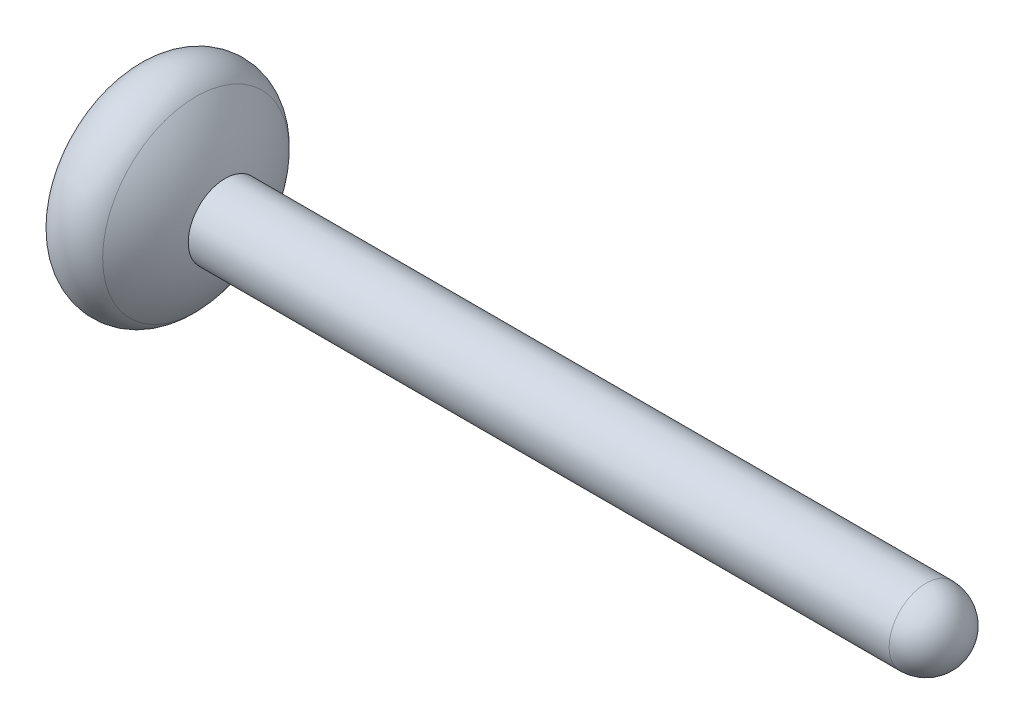
ISO-10303-21;
HEADER;
FILE_DESCRIPTION(('STEP AP214'),'2;1');
FILE_NAME('part.step','',(''),(''),'','','');
FILE_SCHEMA(('AUTOMOTIVE_DESIGN { 1 0 10303 214 1 1 1 1 }'));
ENDSEC;
DATA;
#1=APPLICATION_CONTEXT('core data for automotive mechanical design processes');
#2=APPLICATION_PROTOCOL_DEFINITION('international standard','automotive_design',2000,#1);
#3=PRODUCT_CONTEXT('',#1,'mechanical');
#4=PRODUCT('Part','Part','',(#3));
#5=PRODUCT_RELATED_PRODUCT_CATEGORY('part','',(#4));
#6=PRODUCT_DEFINITION_FORMATION('','',#4);
#7=PRODUCT_DEFINITION_CONTEXT('part definition',#1,'design');
#8=PRODUCT_DEFINITION('design','',#6,#7);
#9=PRODUCT_DEFINITION_SHAPE('','',#8);
#10=(LENGTH_UNIT() NAMED_UNIT(*) SI_UNIT(.MILLI.,.METRE.));
#11=(NAMED_UNIT(*) PLANE_ANGLE_UNIT() SI_UNIT($,.RADIAN.));
#12=(NAMED_UNIT(*) SI_UNIT($,.STERADIAN.) SOLID_ANGLE_UNIT());
#13=UNCERTAINTY_MEASURE_WITH_UNIT(LENGTH_MEASURE(1.E-05),#10,'distance_accuracy_value','');
#14=(GEOMETRIC_REPRESENTATION_CONTEXT(3) GLOBAL_UNCERTAINTY_ASSIGNED_CONTEXT((#13)) GLOBAL_UNIT_ASSIGNED_CONTEXT((#10,
#11,#12)) REPRESENTATION_CONTEXT('',''));
#15=CARTESIAN_POINT('',(0.,0.,0.));
#16=DIRECTION('',(0.,0.,1.));
#17=DIRECTION('',(1.,0.,0.));
#18=AXIS2_PLACEMENT_3D('',#15,#16,#17);
#19=CARTESIAN_POINT('',(0.,0.,0.));
#20=DIRECTION('',(-1.,0.,0.));
#21=DIRECTION('',(0.,0.,1.));
#22=AXIS2_PLACEMENT_3D('',#19,#20,#21);
#23=CYLINDRICAL_SURFACE('',#22,0.5);
#24=CARTESIAN_POINT('',(11.4,0.,0.));
#25=DIRECTION('',(-1.,0.,0.));
#26=DIRECTION('',(0.,0.,1.));
#27=AXIS2_PLACEMENT_3D('',#24,#25,#26);
#28=CIRCLE('',#27,0.5);
#29=CARTESIAN_POINT('',(11.4,0.,0.5));
#30=VERTEX_POINT('',#29);
#31=EDGE_CURVE('E45',#30,#30,#28,.T.);
#32=ORIENTED_EDGE('',*,*,#31,.T.);
#33=EDGE_LOOP('',(#32));
#34=FACE_BOUND('',#33,.T.);
#35=CARTESIAN_POINT('',(1.9,0.,0.));
#36=DIRECTION('',(-1.,0.,0.));
#37=DIRECTION('',(0.,0.,1.));
#38=AXIS2_PLACEMENT_3D('',#35,#36,#37);
#39=CIRCLE('',#38,0.5);
#40=CARTESIAN_POINT('',(1.9,0.,0.5));
#41=VERTEX_POINT('',#40);
#42=EDGE_CURVE('E49',#41,#41,#39,.T.);
#43=ORIENTED_EDGE('',*,*,#42,.F.);
#44=EDGE_LOOP('',(#43));
#45=FACE_BOUND('',#44,.T.);
#46=ADVANCED_FACE('F34',(#34,#45),#23,.T.);
#47=CARTESIAN_POINT('',(0.,0.,0.));
#48=DIRECTION('',(-1.,0.,0.));
#49=DIRECTION('',(0.,1.,0.));
#50=AXIS2_PLACEMENT_3D('',#47,#48,#49);
#51=SPHERICAL_SURFACE('',#50,1.96468827043885);
#52=CARTESIAN_POINT('',(1.50416395454947,0.,0.));
#53=DIRECTION('',(-1.,0.,0.));
#54=DIRECTION('',(0.,0.,1.));
#55=AXIS2_PLACEMENT_3D('',#52,#53,#54);
#56=CIRCLE('',#55,1.26391882565064);
#57=CARTESIAN_POINT('',(1.50416395454947,0.,1.26391882565064));
#58=VERTEX_POINT('',#57);
#59=EDGE_CURVE('E10',#58,#58,#56,.F.);
#60=ORIENTED_EDGE('',*,*,#59,.T.);
#61=EDGE_LOOP('',(#60));
#62=FACE_BOUND('',#61,.T.);
#63=ORIENTED_EDGE('',*,*,#42,.T.);
#64=EDGE_LOOP('',(#63));
#65=FACE_BOUND('',#64,.T.);
#66=ADVANCED_FACE('F62',(#62,#65),#51,.T.);
#67=CARTESIAN_POINT('',(0.98234413521942,0.,0.));
#68=DIRECTION('',(1.,0.,0.));
#69=DIRECTION('',(0.,0.,-1.));
#70=AXIS2_PLACEMENT_3D('',#67,#68,#69);
#71=CONICAL_SURFACE('',#70,1.70146995271736,1.0471975511966);
#72=CARTESIAN_POINT('',(0.68835160520644,0.,0.));
#73=DIRECTION('',(-1.,0.,0.));
#74=DIRECTION('',(0.,0.,1.));
#75=AXIS2_PLACEMENT_3D('',#72,#73,#74);
#76=CIRCLE('',#75,1.19225995368915);
#77=CARTESIAN_POINT('',(0.68835160520644,0.,1.19225995368915));
#78=VERTEX_POINT('',#77);
#79=EDGE_CURVE('E41',#78,#78,#76,.T.);
#80=ORIENTED_EDGE('',*,*,#79,.T.);
#81=EDGE_LOOP('',(#80));
#82=FACE_BOUND('',#81,.T.);
#83=CARTESIAN_POINT('',(0.599999999999997,0.,0.));
#84=DIRECTION('',(-1.,0.,0.));
#85=DIRECTION('',(0.,0.,1.));
#86=AXIS2_PLACEMENT_3D('',#83,#84,#85);
#87=CIRCLE('',#86,1.03923048454133);
#88=CARTESIAN_POINT('',(0.599999999999997,0.,1.03923048454133));
#89=VERTEX_POINT('',#88);
#90=EDGE_CURVE('E54',#89,#89,#87,.T.);
#91=ORIENTED_EDGE('',*,*,#90,.F.);
#92=EDGE_LOOP('',(#91));
#93=FACE_BOUND('',#92,.T.);
#94=ADVANCED_FACE('F60',(#82,#93),#71,.T.);
#95=CARTESIAN_POINT('',(0.,0.,0.));
#96=DIRECTION('',(-1.,0.,0.));
#97=DIRECTION('',(0.,1.,0.));
#98=AXIS2_PLACEMENT_3D('',#95,#96,#97);
#99=SPHERICAL_SURFACE('',#98,1.2);
#100=ORIENTED_EDGE('',*,*,#90,.T.);
#101=EDGE_LOOP('',(#100));
#102=FACE_BOUND('',#101,.T.);
#103=ADVANCED_FACE('F58',(#102),#99,.F.);
#104=CARTESIAN_POINT('',(11.4,0.,0.));
#105=DIRECTION('',(-1.,0.,0.));
#106=DIRECTION('',(0.,0.,1.));
#107=AXIS2_PLACEMENT_3D('',#104,#105,#106);
#108=SPHERICAL_SURFACE('',#107,0.5);
#109=ORIENTED_EDGE('',*,*,#31,.F.);
#110=EDGE_LOOP('',(#109));
#111=FACE_BOUND('',#110,.T.);
#112=ADVANCED_FACE('F68',(#111),#108,.T.);
#113=CARTESIAN_POINT('',(1.12136430709866,0.,0.));
#114=DIRECTION('',(-1.,0.,0.));
#115=DIRECTION('',(0.,0.,1.));
#116=AXIS2_PLACEMENT_3D('',#113,#114,#115);
#117=TOROIDAL_SURFACE('',#116,0.942259953689155,0.5);
#118=ORIENTED_EDGE('',*,*,#59,.F.);
#119=EDGE_LOOP('',(#118));
#120=FACE_BOUND('',#119,.T.);
#121=ORIENTED_EDGE('',*,*,#79,.F.);
#122=EDGE_LOOP('',(#121));
#123=FACE_BOUND('',#122,.T.);
#124=ADVANCED_FACE('F36',(#120,#123),#117,.T.);
#125=CLOSED_SHELL('',(#46,#66,#94,#103,#112,#124));
#126=MANIFOLD_SOLID_BREP('B2',#125);
#127=ADVANCED_BREP_SHAPE_REPRESENTATION('',(#18,#126),#14);
#128=SHAPE_DEFINITION_REPRESENTATION(#9,#127);
ENDSEC;
END-ISO-10303-21;
